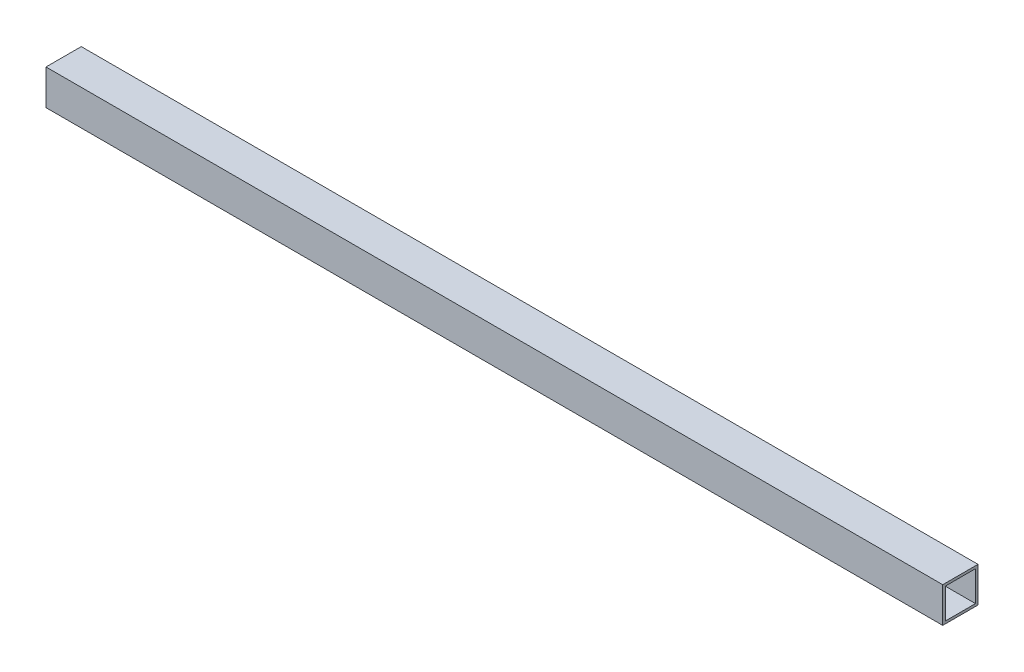
ISO-10303-21;
HEADER;
FILE_DESCRIPTION(('STEP AP214'),'2;1');
FILE_NAME('part.step','',(''),(''),'','','');
FILE_SCHEMA(('AUTOMOTIVE_DESIGN { 1 0 10303 214 1 1 1 1 }'));
ENDSEC;
DATA;
#1=APPLICATION_CONTEXT('core data for automotive mechanical design processes');
#2=APPLICATION_PROTOCOL_DEFINITION('international standard','automotive_design',2000,#1);
#3=PRODUCT_CONTEXT('',#1,'mechanical');
#4=PRODUCT('Part','Part','',(#3));
#5=PRODUCT_RELATED_PRODUCT_CATEGORY('part','',(#4));
#6=PRODUCT_DEFINITION_FORMATION('','',#4);
#7=PRODUCT_DEFINITION_CONTEXT('part definition',#1,'design');
#8=PRODUCT_DEFINITION('design','',#6,#7);
#9=PRODUCT_DEFINITION_SHAPE('','',#8);
#10=(LENGTH_UNIT() NAMED_UNIT(*) SI_UNIT(.MILLI.,.METRE.));
#11=(NAMED_UNIT(*) PLANE_ANGLE_UNIT() SI_UNIT($,.RADIAN.));
#12=(NAMED_UNIT(*) SI_UNIT($,.STERADIAN.) SOLID_ANGLE_UNIT());
#13=UNCERTAINTY_MEASURE_WITH_UNIT(LENGTH_MEASURE(1.E-05),#10,'distance_accuracy_value','');
#14=(GEOMETRIC_REPRESENTATION_CONTEXT(3) GLOBAL_UNCERTAINTY_ASSIGNED_CONTEXT((#13)) GLOBAL_UNIT_ASSIGNED_CONTEXT((#10,
#11,#12)) REPRESENTATION_CONTEXT('',''));
#15=CARTESIAN_POINT('',(0.,0.,0.));
#16=DIRECTION('',(0.,0.,1.));
#17=DIRECTION('',(1.,0.,0.));
#18=AXIS2_PLACEMENT_3D('',#15,#16,#17);
#19=CARTESIAN_POINT('',(565.152,-19.0500000000008,-298.450000000002));
#20=DIRECTION('',(0.,-0.999999999999992,0.));
#21=DIRECTION('',(0.,0.,-1.00000000000001));
#22=AXIS2_PLACEMENT_3D('',#19,#20,#21);
#23=PLANE('',#22);
#24=DIRECTION('',(0.,0.,-1.00000000000001));
#25=VECTOR('',#24,1.);
#26=CARTESIAN_POINT('',(-565.15,-19.0499999999987,-298.450000000001));
#27=LINE('',#26,#25);
#28=CARTESIAN_POINT('',(-565.15,-19.0499999999985,-339.725000000001));
#29=VERTEX_POINT('',#28);
#30=CARTESIAN_POINT('',(-565.15,-19.0499999999987,-301.625000000001));
#31=VERTEX_POINT('',#30);
#32=EDGE_CURVE('E98',#29,#31,#27,.F.);
#33=ORIENTED_EDGE('',*,*,#32,.T.);
#34=DIRECTION('',(1.,0.,0.));
#35=VECTOR('',#34,1.);
#36=CARTESIAN_POINT('',(565.152,-19.050000000002,-301.625000000003));
#37=LINE('',#36,#35);
#38=CARTESIAN_POINT('',(565.15,-19.050000000002,-301.625000000003));
#39=VERTEX_POINT('',#38);
#40=EDGE_CURVE('E17',#31,#39,#37,.T.);
#41=ORIENTED_EDGE('',*,*,#40,.T.);
#42=DIRECTION('',(0.,0.,-1.00000000000001));
#43=VECTOR('',#42,1.);
#44=CARTESIAN_POINT('',(565.15,-19.0500000000008,-298.450000000004));
#45=LINE('',#44,#43);
#46=CARTESIAN_POINT('',(565.15,-19.0500000000008,-339.725000000003));
#47=VERTEX_POINT('',#46);
#48=EDGE_CURVE('E109',#47,#39,#45,.F.);
#49=ORIENTED_EDGE('',*,*,#48,.F.);
#50=DIRECTION('',(-1.,0.,0.));
#51=VECTOR('',#50,1.);
#52=CARTESIAN_POINT('',(565.152,-19.0500000000008,-339.725000000003));
#53=LINE('',#52,#51);
#54=EDGE_CURVE('E90',#47,#29,#53,.T.);
#55=ORIENTED_EDGE('',*,*,#54,.T.);
#56=EDGE_LOOP('',(#33,#41,#49,#55));
#57=FACE_BOUND('',#56,.T.);
#58=ADVANCED_FACE('F14',(#57),#23,.F.);
#59=CARTESIAN_POINT('',(565.152,-2.33146835171283E-12,-301.625000000003));
#60=DIRECTION('',(0.,0.,1.00000000000001));
#61=DIRECTION('',(1.,0.,0.));
#62=AXIS2_PLACEMENT_3D('',#59,#60,#61);
#63=PLANE('',#62);
#64=DIRECTION('',(0.,0.999999999999992,0.));
#65=VECTOR('',#64,1.);
#66=CARTESIAN_POINT('',(-565.15,1.33226762955019E-12,-301.625000000002));
#67=LINE('',#66,#65);
#68=CARTESIAN_POINT('',(-565.15,19.0500000000013,-301.625000000002));
#69=VERTEX_POINT('',#68);
#70=EDGE_CURVE('E127',#31,#69,#67,.T.);
#71=ORIENTED_EDGE('',*,*,#70,.T.);
#72=DIRECTION('',(1.,0.,0.));
#73=VECTOR('',#72,1.);
#74=CARTESIAN_POINT('',(565.152,19.0499999999973,-301.625000000003));
#75=LINE('',#74,#73);
#76=CARTESIAN_POINT('',(565.15,19.0499999999973,-301.625000000004));
#77=VERTEX_POINT('',#76);
#78=EDGE_CURVE('E76',#69,#77,#75,.T.);
#79=ORIENTED_EDGE('',*,*,#78,.T.);
#80=DIRECTION('',(0.,0.999999999999992,0.));
#81=VECTOR('',#80,1.);
#82=CARTESIAN_POINT('',(565.15,-2.33146835171283E-12,-301.625000000003));
#83=LINE('',#82,#81);
#84=EDGE_CURVE('E110',#39,#77,#83,.T.);
#85=ORIENTED_EDGE('',*,*,#84,.F.);
#86=ORIENTED_EDGE('',*,*,#40,.F.);
#87=EDGE_LOOP('',(#71,#79,#85,#86));
#88=FACE_BOUND('',#87,.T.);
#89=ADVANCED_FACE('F111',(#88),#63,.F.);
#90=CARTESIAN_POINT('',(565.152,19.0499999999973,-298.450000000002));
#91=DIRECTION('',(0.,0.999999999999992,0.));
#92=DIRECTION('',(0.,0.,1.00000000000001));
#93=AXIS2_PLACEMENT_3D('',#90,#91,#92);
#94=PLANE('',#93);
#95=DIRECTION('',(0.,0.,-1.00000000000001));
#96=VECTOR('',#95,1.);
#97=CARTESIAN_POINT('',(-565.15,19.0500000000013,-298.450000000002));
#98=LINE('',#97,#96);
#99=CARTESIAN_POINT('',(-565.15,19.0500000000013,-339.725000000002));
#100=VERTEX_POINT('',#99);
#101=EDGE_CURVE('E89',#69,#100,#98,.T.);
#102=ORIENTED_EDGE('',*,*,#101,.T.);
#103=DIRECTION('',(-1.,0.,0.));
#104=VECTOR('',#103,1.);
#105=CARTESIAN_POINT('',(565.152,19.0499999999986,-339.725000000002));
#106=LINE('',#105,#104);
#107=CARTESIAN_POINT('',(565.15,19.0499999999986,-339.725000000003));
#108=VERTEX_POINT('',#107);
#109=EDGE_CURVE('E83',#100,#108,#106,.F.);
#110=ORIENTED_EDGE('',*,*,#109,.T.);
#111=DIRECTION('',(0.,0.,-1.00000000000001));
#112=VECTOR('',#111,1.);
#113=CARTESIAN_POINT('',(565.15,19.0499999999973,-298.450000000004));
#114=LINE('',#113,#112);
#115=EDGE_CURVE('E113',#77,#108,#114,.T.);
#116=ORIENTED_EDGE('',*,*,#115,.F.);
#117=ORIENTED_EDGE('',*,*,#78,.F.);
#118=EDGE_LOOP('',(#102,#110,#116,#117));
#119=FACE_BOUND('',#118,.T.);
#120=ADVANCED_FACE('F100',(#119),#94,.F.);
#121=CARTESIAN_POINT('',(565.152,-1.11022302462516E-12,-339.725000000003));
#122=DIRECTION('',(0.,0.,-1.00000000000001));
#123=DIRECTION('',(-1.,0.,0.));
#124=AXIS2_PLACEMENT_3D('',#121,#122,#123);
#125=PLANE('',#124);
#126=DIRECTION('',(0.,0.999999999999992,0.));
#127=VECTOR('',#126,1.);
#128=CARTESIAN_POINT('',(-565.15,1.33226762955019E-12,-339.725000000002));
#129=LINE('',#128,#127);
#130=EDGE_CURVE('E86',#100,#29,#129,.F.);
#131=ORIENTED_EDGE('',*,*,#130,.T.);
#132=ORIENTED_EDGE('',*,*,#54,.F.);
#133=DIRECTION('',(0.,0.999999999999992,0.));
#134=VECTOR('',#133,1.);
#135=CARTESIAN_POINT('',(565.15,-1.11022302462516E-12,-339.725000000003));
#136=LINE('',#135,#134);
#137=EDGE_CURVE('E88',#108,#47,#136,.F.);
#138=ORIENTED_EDGE('',*,*,#137,.F.);
#139=ORIENTED_EDGE('',*,*,#109,.F.);
#140=EDGE_LOOP('',(#131,#132,#138,#139));
#141=FACE_BOUND('',#140,.T.);
#142=ADVANCED_FACE('F85',(#141),#125,.F.);
#143=CARTESIAN_POINT('',(-1.11022302462516E-12,2.22044604925031E-13,-298.450000000002));
#144=DIRECTION('',(0.,0.,1.00000000000001));
#145=DIRECTION('',(1.,0.,0.));
#146=AXIS2_PLACEMENT_3D('',#143,#144,#145);
#147=PLANE('',#146);
#148=DIRECTION('',(1.,0.,0.));
#149=VECTOR('',#148,1.);
#150=CARTESIAN_POINT('',(-1.11022302462516E-12,-22.2249999999997,-298.450000000002));
#151=LINE('',#150,#149);
#152=CARTESIAN_POINT('',(-565.15,-22.2249999999987,-298.450000000002));
#153=VERTEX_POINT('',#152);
#154=CARTESIAN_POINT('',(565.15,-22.2250000000008,-298.450000000004));
#155=VERTEX_POINT('',#154);
#156=EDGE_CURVE('E116',#153,#155,#151,.T.);
#157=ORIENTED_EDGE('',*,*,#156,.T.);
#158=DIRECTION('',(0.,0.999999999999992,0.));
#159=VECTOR('',#158,1.);
#160=CARTESIAN_POINT('',(565.15,-2.33146835171283E-12,-298.450000000004));
#161=LINE('',#160,#159);
#162=CARTESIAN_POINT('',(565.15,22.2249999999974,-298.450000000004));
#163=VERTEX_POINT('',#162);
#164=EDGE_CURVE('E156',#163,#155,#161,.F.);
#165=ORIENTED_EDGE('',*,*,#164,.F.);
#166=DIRECTION('',(1.,0.,0.));
#167=VECTOR('',#166,1.);
#168=CARTESIAN_POINT('',(-1.11022302462516E-12,22.2249999999999,-298.450000000002));
#169=LINE('',#168,#167);
#170=CARTESIAN_POINT('',(-565.15,22.2250000000014,-298.450000000002));
#171=VERTEX_POINT('',#170);
#172=EDGE_CURVE('E134',#171,#163,#169,.T.);
#173=ORIENTED_EDGE('',*,*,#172,.F.);
#174=DIRECTION('',(0.,0.999999999999992,0.));
#175=VECTOR('',#174,1.);
#176=CARTESIAN_POINT('',(-565.15,1.33226762955019E-12,-298.450000000002));
#177=LINE('',#176,#175);
#178=EDGE_CURVE('E125',#171,#153,#177,.F.);
#179=ORIENTED_EDGE('',*,*,#178,.T.);
#180=EDGE_LOOP('',(#157,#165,#173,#179));
#181=FACE_BOUND('',#180,.T.);
#182=ADVANCED_FACE('F131',(#181),#147,.T.);
#183=CARTESIAN_POINT('',(-565.15,1.33226762955019E-12,-298.450000000002));
#184=DIRECTION('',(1.,0.,0.));
#185=DIRECTION('',(0.,0.,-1.00000000000001));
#186=AXIS2_PLACEMENT_3D('',#183,#184,#185);
#187=PLANE('',#186);
#188=DIRECTION('',(0.,0.,1.00000000000001));
#189=VECTOR('',#188,1.);
#190=CARTESIAN_POINT('',(-565.15,-22.2249999999987,-298.450000000002));
#191=LINE('',#190,#189);
#192=CARTESIAN_POINT('',(-565.15,-22.2249999999983,-342.900000000002));
#193=VERTEX_POINT('',#192);
#194=EDGE_CURVE('E122',#193,#153,#191,.T.);
#195=ORIENTED_EDGE('',*,*,#194,.T.);
#196=ORIENTED_EDGE('',*,*,#178,.F.);
#197=DIRECTION('',(0.,0.,1.00000000000001));
#198=VECTOR('',#197,1.);
#199=CARTESIAN_POINT('',(-565.15,22.2250000000014,-298.450000000002));
#200=LINE('',#199,#198);
#201=CARTESIAN_POINT('',(-565.15,22.2250000000001,-342.900000000002));
#202=VERTEX_POINT('',#201);
#203=EDGE_CURVE('E145',#202,#171,#200,.T.);
#204=ORIENTED_EDGE('',*,*,#203,.F.);
#205=DIRECTION('',(0.,0.999999999999992,0.));
#206=VECTOR('',#205,1.);
#207=CARTESIAN_POINT('',(-565.15,1.11022302462516E-13,-342.900000000002));
#208=LINE('',#207,#206);
#209=EDGE_CURVE('E144',#202,#193,#208,.F.);
#210=ORIENTED_EDGE('',*,*,#209,.T.);
#211=EDGE_LOOP('',(#195,#196,#204,#210));
#212=FACE_BOUND('',#211,.T.);
#213=ORIENTED_EDGE('',*,*,#32,.F.);
#214=ORIENTED_EDGE('',*,*,#130,.F.);
#215=ORIENTED_EDGE('',*,*,#101,.F.);
#216=ORIENTED_EDGE('',*,*,#70,.F.);
#217=EDGE_LOOP('',(#213,#214,#215,#216));
#218=FACE_BOUND('',#217,.T.);
#219=ADVANCED_FACE('F94',(#212,#218),#187,.F.);
#220=CARTESIAN_POINT('',(-1.11022302462516E-12,-22.2249999999997,-298.450000000002));
#221=DIRECTION('',(0.,0.999999999999992,0.));
#222=DIRECTION('',(0.,0.,1.00000000000001));
#223=AXIS2_PLACEMENT_3D('',#220,#221,#222);
#224=PLANE('',#223);
#225=DIRECTION('',(0.,0.,-1.00000000000001));
#226=VECTOR('',#225,1.);
#227=CARTESIAN_POINT('',(565.15,-22.2250000000008,-298.450000000004));
#228=LINE('',#227,#226);
#229=CARTESIAN_POINT('',(565.15,-22.2250000000008,-342.900000000004));
#230=VERTEX_POINT('',#229);
#231=EDGE_CURVE('E142',#155,#230,#228,.T.);
#232=ORIENTED_EDGE('',*,*,#231,.F.);
#233=ORIENTED_EDGE('',*,*,#156,.F.);
#234=ORIENTED_EDGE('',*,*,#194,.F.);
#235=DIRECTION('',(1.,0.,0.));
#236=VECTOR('',#235,1.);
#237=CARTESIAN_POINT('',(0.,-22.2249999999997,-342.900000000003));
#238=LINE('',#237,#236);
#239=EDGE_CURVE('E147',#193,#230,#238,.T.);
#240=ORIENTED_EDGE('',*,*,#239,.T.);
#241=EDGE_LOOP('',(#232,#233,#234,#240));
#242=FACE_BOUND('',#241,.T.);
#243=ADVANCED_FACE('F139',(#242),#224,.F.);
#244=CARTESIAN_POINT('',(565.15,-2.33146835171283E-12,-298.450000000004));
#245=DIRECTION('',(1.,0.,0.));
#246=DIRECTION('',(0.,0.,-1.00000000000001));
#247=AXIS2_PLACEMENT_3D('',#244,#245,#246);
#248=PLANE('',#247);
#249=ORIENTED_EDGE('',*,*,#164,.T.);
#250=ORIENTED_EDGE('',*,*,#231,.T.);
#251=DIRECTION('',(0.,0.999999999999992,0.));
#252=VECTOR('',#251,1.);
#253=CARTESIAN_POINT('',(565.15,-1.11022302462516E-12,-342.900000000004));
#254=LINE('',#253,#252);
#255=CARTESIAN_POINT('',(565.15,22.2249999999986,-342.900000000003));
#256=VERTEX_POINT('',#255);
#257=EDGE_CURVE('E23',#230,#256,#254,.T.);
#258=ORIENTED_EDGE('',*,*,#257,.T.);
#259=DIRECTION('',(0.,0.,1.00000000000001));
#260=VECTOR('',#259,1.);
#261=CARTESIAN_POINT('',(565.15,22.2249999999974,-298.450000000004));
#262=LINE('',#261,#260);
#263=EDGE_CURVE('E31',#163,#256,#262,.F.);
#264=ORIENTED_EDGE('',*,*,#263,.F.);
#265=EDGE_LOOP('',(#249,#250,#258,#264));
#266=FACE_BOUND('',#265,.T.);
#267=ORIENTED_EDGE('',*,*,#115,.T.);
#268=ORIENTED_EDGE('',*,*,#137,.T.);
#269=ORIENTED_EDGE('',*,*,#48,.T.);
#270=ORIENTED_EDGE('',*,*,#84,.T.);
#271=EDGE_LOOP('',(#267,#268,#269,#270));
#272=FACE_BOUND('',#271,.T.);
#273=ADVANCED_FACE('F157',(#266,#272),#248,.T.);
#274=CARTESIAN_POINT('',(-1.11022302462516E-12,22.2249999999999,-298.450000000002));
#275=DIRECTION('',(0.,0.999999999999992,0.));
#276=DIRECTION('',(0.,0.,1.00000000000001));
#277=AXIS2_PLACEMENT_3D('',#274,#275,#276);
#278=PLANE('',#277);
#279=ORIENTED_EDGE('',*,*,#172,.T.);
#280=ORIENTED_EDGE('',*,*,#263,.T.);
#281=DIRECTION('',(1.,0.,0.));
#282=VECTOR('',#281,1.);
#283=CARTESIAN_POINT('',(9.99200722162641E-13,22.2249999999999,-342.900000000003));
#284=LINE('',#283,#282);
#285=EDGE_CURVE('E9',#256,#202,#284,.F.);
#286=ORIENTED_EDGE('',*,*,#285,.T.);
#287=ORIENTED_EDGE('',*,*,#203,.T.);
#288=EDGE_LOOP('',(#279,#280,#286,#287));
#289=FACE_BOUND('',#288,.T.);
#290=ADVANCED_FACE('F159',(#289),#278,.T.);
#291=CARTESIAN_POINT('',(0.,3.33066907387547E-13,-342.900000000003));
#292=DIRECTION('',(0.,0.,1.00000000000001));
#293=DIRECTION('',(1.,0.,0.));
#294=AXIS2_PLACEMENT_3D('',#291,#292,#293);
#295=PLANE('',#294);
#296=ORIENTED_EDGE('',*,*,#257,.F.);
#297=ORIENTED_EDGE('',*,*,#239,.F.);
#298=ORIENTED_EDGE('',*,*,#209,.F.);
#299=ORIENTED_EDGE('',*,*,#285,.F.);
#300=EDGE_LOOP('',(#296,#297,#298,#299));
#301=FACE_BOUND('',#300,.T.);
#302=ADVANCED_FACE('F167',(#301),#295,.F.);
#303=CLOSED_SHELL('',(#58,#89,#120,#142,#182,#219,#243,#273,#290,#302));
#304=MANIFOLD_SOLID_BREP('B1',#303);
#305=ADVANCED_BREP_SHAPE_REPRESENTATION('',(#18,#304),#14);
#306=SHAPE_DEFINITION_REPRESENTATION(#9,#305);
ENDSEC;
END-ISO-10303-21;
